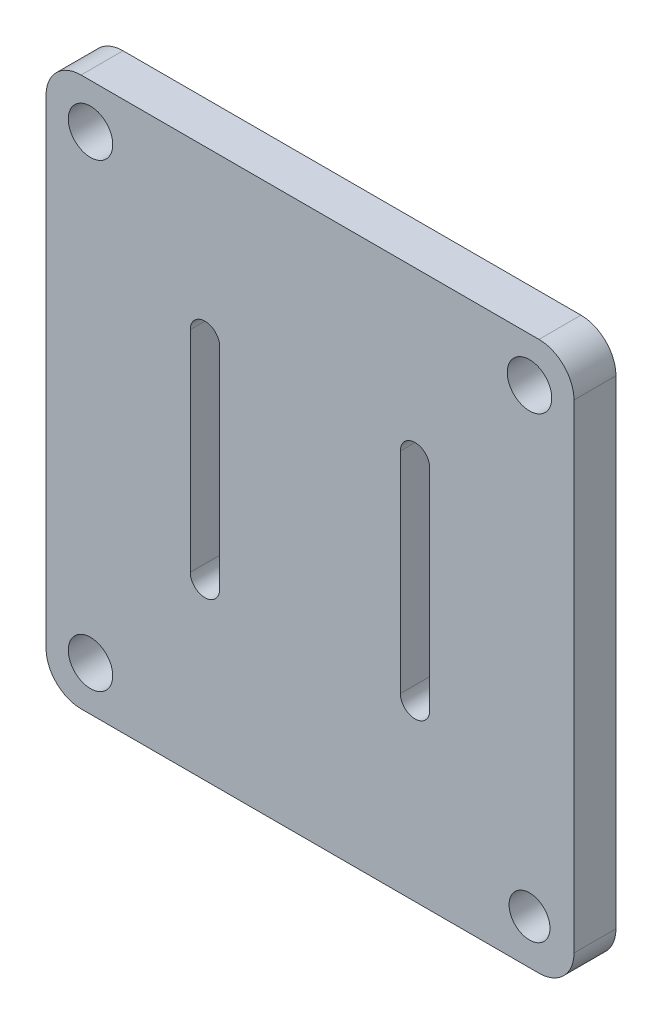
ISO-10303-21;
HEADER;
FILE_DESCRIPTION(('STEP AP214'),'2;1');
FILE_NAME('part.step','',(''),(''),'','','');
FILE_SCHEMA(('AUTOMOTIVE_DESIGN { 1 0 10303 214 1 1 1 1 }'));
ENDSEC;
DATA;
#1=APPLICATION_CONTEXT('core data for automotive mechanical design processes');
#2=APPLICATION_PROTOCOL_DEFINITION('international standard','automotive_design',2000,#1);
#3=PRODUCT_CONTEXT('',#1,'mechanical');
#4=PRODUCT('Part','Part','',(#3));
#5=PRODUCT_RELATED_PRODUCT_CATEGORY('part','',(#4));
#6=PRODUCT_DEFINITION_FORMATION('','',#4);
#7=PRODUCT_DEFINITION_CONTEXT('part definition',#1,'design');
#8=PRODUCT_DEFINITION('design','',#6,#7);
#9=PRODUCT_DEFINITION_SHAPE('','',#8);
#10=(LENGTH_UNIT() NAMED_UNIT(*) SI_UNIT(.MILLI.,.METRE.));
#11=(NAMED_UNIT(*) PLANE_ANGLE_UNIT() SI_UNIT($,.RADIAN.));
#12=(NAMED_UNIT(*) SI_UNIT($,.STERADIAN.) SOLID_ANGLE_UNIT());
#13=UNCERTAINTY_MEASURE_WITH_UNIT(LENGTH_MEASURE(1.E-05),#10,'distance_accuracy_value','');
#14=(GEOMETRIC_REPRESENTATION_CONTEXT(3) GLOBAL_UNCERTAINTY_ASSIGNED_CONTEXT((#13)) GLOBAL_UNIT_ASSIGNED_CONTEXT((#10,
#11,#12)) REPRESENTATION_CONTEXT('',''));
#15=CARTESIAN_POINT('',(0.,0.,0.));
#16=DIRECTION('',(0.,0.,1.));
#17=DIRECTION('',(1.,0.,0.));
#18=AXIS2_PLACEMENT_3D('',#15,#16,#17);
#19=CARTESIAN_POINT('',(-566.61706408043,0.,5.9944));
#20=DIRECTION('',(-1.,0.,0.));
#21=DIRECTION('',(0.,0.,1.));
#22=AXIS2_PLACEMENT_3D('',#19,#20,#21);
#23=PLANE('',#22);
#24=DIRECTION('',(0.,1.,0.));
#25=VECTOR('',#24,1.);
#26=CARTESIAN_POINT('',(-566.61706408043,0.,0.));
#27=LINE('',#26,#25);
#28=CARTESIAN_POINT('',(-566.61706408043,610.968899583057,0.));
#29=VERTEX_POINT('',#28);
#30=CARTESIAN_POINT('',(-566.61706408043,679.368899583057,0.));
#31=VERTEX_POINT('',#30);
#32=EDGE_CURVE('E217',#29,#31,#27,.T.);
#33=ORIENTED_EDGE('',*,*,#32,.T.);
#34=DIRECTION('',(0.,0.,-1.));
#35=VECTOR('',#34,1.);
#36=CARTESIAN_POINT('',(-566.61706408043,679.368899583057,5.9944));
#37=LINE('',#36,#35);
#38=CARTESIAN_POINT('',(-566.61706408043,679.368899583057,5.9944));
#39=VERTEX_POINT('',#38);
#40=EDGE_CURVE('E11',#39,#31,#37,.T.);
#41=ORIENTED_EDGE('',*,*,#40,.F.);
#42=DIRECTION('',(0.,1.,0.));
#43=VECTOR('',#42,1.);
#44=CARTESIAN_POINT('',(-566.61706408043,0.,5.9944));
#45=LINE('',#44,#43);
#46=CARTESIAN_POINT('',(-566.61706408043,610.968899583057,5.9944));
#47=VERTEX_POINT('',#46);
#48=EDGE_CURVE('E306',#47,#39,#45,.T.);
#49=ORIENTED_EDGE('',*,*,#48,.F.);
#50=DIRECTION('',(0.,0.,-1.));
#51=VECTOR('',#50,1.);
#52=CARTESIAN_POINT('',(-566.61706408043,610.968899583057,5.9944));
#53=LINE('',#52,#51);
#54=EDGE_CURVE('E232',#47,#29,#53,.T.);
#55=ORIENTED_EDGE('',*,*,#54,.T.);
#56=EDGE_LOOP('',(#33,#41,#49,#55));
#57=FACE_BOUND('',#56,.T.);
#58=ADVANCED_FACE('F33',(#57),#23,.F.);
#59=CARTESIAN_POINT('',(-571.61706408043,679.368899583057,5.9944));
#60=DIRECTION('',(0.,0.,-1.));
#61=DIRECTION('',(-1.,0.,0.));
#62=AXIS2_PLACEMENT_3D('',#59,#60,#61);
#63=CYLINDRICAL_SURFACE('',#62,5.);
#64=CARTESIAN_POINT('',(-571.61706408043,679.368899583057,0.));
#65=DIRECTION('',(0.,0.,1.));
#66=DIRECTION('',(1.,0.,0.));
#67=AXIS2_PLACEMENT_3D('',#64,#65,#66);
#68=CIRCLE('',#67,5.);
#69=CARTESIAN_POINT('',(-571.61706408043,684.368899583057,0.));
#70=VERTEX_POINT('',#69);
#71=EDGE_CURVE('E220',#31,#70,#68,.T.);
#72=ORIENTED_EDGE('',*,*,#71,.T.);
#73=DIRECTION('',(0.,0.,-1.));
#74=VECTOR('',#73,1.);
#75=CARTESIAN_POINT('',(-571.61706408043,684.368899583057,5.9944));
#76=LINE('',#75,#74);
#77=CARTESIAN_POINT('',(-571.61706408043,684.368899583057,5.9944));
#78=VERTEX_POINT('',#77);
#79=EDGE_CURVE('E43',#78,#70,#76,.T.);
#80=ORIENTED_EDGE('',*,*,#79,.F.);
#81=CARTESIAN_POINT('',(-571.61706408043,679.368899583057,5.9944));
#82=DIRECTION('',(0.,0.,1.));
#83=DIRECTION('',(1.,0.,0.));
#84=AXIS2_PLACEMENT_3D('',#81,#82,#83);
#85=CIRCLE('',#84,5.);
#86=EDGE_CURVE('E308',#39,#78,#85,.T.);
#87=ORIENTED_EDGE('',*,*,#86,.F.);
#88=ORIENTED_EDGE('',*,*,#40,.T.);
#89=EDGE_LOOP('',(#72,#80,#87,#88));
#90=FACE_BOUND('',#89,.T.);
#91=ADVANCED_FACE('F342',(#90),#63,.T.);
#92=CARTESIAN_POINT('',(0.,684.368899583057,5.9944));
#93=DIRECTION('',(0.,-1.,0.));
#94=DIRECTION('',(0.,0.,-1.));
#95=AXIS2_PLACEMENT_3D('',#92,#93,#94);
#96=PLANE('',#95);
#97=DIRECTION('',(-1.,0.,0.));
#98=VECTOR('',#97,1.);
#99=CARTESIAN_POINT('',(0.,684.368899583057,0.));
#100=LINE('',#99,#98);
#101=CARTESIAN_POINT('',(-637.017064080431,684.368899583057,0.));
#102=VERTEX_POINT('',#101);
#103=EDGE_CURVE('E222',#70,#102,#100,.T.);
#104=ORIENTED_EDGE('',*,*,#103,.T.);
#105=DIRECTION('',(0.,0.,-1.));
#106=VECTOR('',#105,1.);
#107=CARTESIAN_POINT('',(-637.017064080431,684.368899583057,5.9944));
#108=LINE('',#107,#106);
#109=CARTESIAN_POINT('',(-637.017064080431,684.368899583057,5.9944));
#110=VERTEX_POINT('',#109);
#111=EDGE_CURVE('E240',#110,#102,#108,.T.);
#112=ORIENTED_EDGE('',*,*,#111,.F.);
#113=DIRECTION('',(-1.,0.,0.));
#114=VECTOR('',#113,1.);
#115=CARTESIAN_POINT('',(0.,684.368899583057,5.9944));
#116=LINE('',#115,#114);
#117=EDGE_CURVE('E310',#78,#110,#116,.T.);
#118=ORIENTED_EDGE('',*,*,#117,.F.);
#119=ORIENTED_EDGE('',*,*,#79,.T.);
#120=EDGE_LOOP('',(#104,#112,#118,#119));
#121=FACE_BOUND('',#120,.T.);
#122=ADVANCED_FACE('F347',(#121),#96,.F.);
#123=CARTESIAN_POINT('',(-637.017064080431,679.368899583057,5.9944));
#124=DIRECTION('',(0.,0.,-1.));
#125=DIRECTION('',(-1.,0.,0.));
#126=AXIS2_PLACEMENT_3D('',#123,#124,#125);
#127=CYLINDRICAL_SURFACE('',#126,5.);
#128=CARTESIAN_POINT('',(-637.017064080431,679.368899583057,0.));
#129=DIRECTION('',(0.,0.,1.));
#130=DIRECTION('',(1.,0.,0.));
#131=AXIS2_PLACEMENT_3D('',#128,#129,#130);
#132=CIRCLE('',#131,5.);
#133=CARTESIAN_POINT('',(-642.017064080431,679.368899583057,0.));
#134=VERTEX_POINT('',#133);
#135=EDGE_CURVE('E224',#102,#134,#132,.T.);
#136=ORIENTED_EDGE('',*,*,#135,.T.);
#137=DIRECTION('',(0.,0.,-1.));
#138=VECTOR('',#137,1.);
#139=CARTESIAN_POINT('',(-642.017064080431,679.368899583057,5.9944));
#140=LINE('',#139,#138);
#141=CARTESIAN_POINT('',(-642.017064080431,679.368899583057,5.9944));
#142=VERTEX_POINT('',#141);
#143=EDGE_CURVE('E237',#142,#134,#140,.T.);
#144=ORIENTED_EDGE('',*,*,#143,.F.);
#145=CARTESIAN_POINT('',(-637.017064080431,679.368899583057,5.9944));
#146=DIRECTION('',(0.,0.,1.));
#147=DIRECTION('',(1.,0.,0.));
#148=AXIS2_PLACEMENT_3D('',#145,#146,#147);
#149=CIRCLE('',#148,5.);
#150=EDGE_CURVE('E312',#110,#142,#149,.T.);
#151=ORIENTED_EDGE('',*,*,#150,.F.);
#152=ORIENTED_EDGE('',*,*,#111,.T.);
#153=EDGE_LOOP('',(#136,#144,#151,#152));
#154=FACE_BOUND('',#153,.T.);
#155=ADVANCED_FACE('F318',(#154),#127,.T.);
#156=CARTESIAN_POINT('',(-642.017064080431,0.,5.9944));
#157=DIRECTION('',(1.,0.,0.));
#158=DIRECTION('',(0.,0.,-1.));
#159=AXIS2_PLACEMENT_3D('',#156,#157,#158);
#160=PLANE('',#159);
#161=DIRECTION('',(0.,-1.,0.));
#162=VECTOR('',#161,1.);
#163=CARTESIAN_POINT('',(-642.017064080431,0.,0.));
#164=LINE('',#163,#162);
#165=CARTESIAN_POINT('',(-642.017064080431,610.968899583057,0.));
#166=VERTEX_POINT('',#165);
#167=EDGE_CURVE('E226',#134,#166,#164,.T.);
#168=ORIENTED_EDGE('',*,*,#167,.T.);
#169=DIRECTION('',(0.,0.,-1.));
#170=VECTOR('',#169,1.);
#171=CARTESIAN_POINT('',(-642.017064080431,610.968899583057,5.9944));
#172=LINE('',#171,#170);
#173=CARTESIAN_POINT('',(-642.017064080431,610.968899583057,5.9944));
#174=VERTEX_POINT('',#173);
#175=EDGE_CURVE('E172',#174,#166,#172,.T.);
#176=ORIENTED_EDGE('',*,*,#175,.F.);
#177=DIRECTION('',(0.,-1.,0.));
#178=VECTOR('',#177,1.);
#179=CARTESIAN_POINT('',(-642.017064080431,0.,5.9944));
#180=LINE('',#179,#178);
#181=EDGE_CURVE('E163',#142,#174,#180,.T.);
#182=ORIENTED_EDGE('',*,*,#181,.F.);
#183=ORIENTED_EDGE('',*,*,#143,.T.);
#184=EDGE_LOOP('',(#168,#176,#182,#183));
#185=FACE_BOUND('',#184,.T.);
#186=ADVANCED_FACE('F322',(#185),#160,.F.);
#187=CARTESIAN_POINT('',(-637.017064080431,610.968899583057,5.9944));
#188=DIRECTION('',(0.,0.,-1.));
#189=DIRECTION('',(-1.,0.,0.));
#190=AXIS2_PLACEMENT_3D('',#187,#188,#189);
#191=CYLINDRICAL_SURFACE('',#190,5.);
#192=CARTESIAN_POINT('',(-637.017064080431,610.968899583057,0.));
#193=DIRECTION('',(0.,0.,1.));
#194=DIRECTION('',(1.,0.,0.));
#195=AXIS2_PLACEMENT_3D('',#192,#193,#194);
#196=CIRCLE('',#195,5.);
#197=CARTESIAN_POINT('',(-637.017064080431,605.968899583057,0.));
#198=VERTEX_POINT('',#197);
#199=EDGE_CURVE('E171',#166,#198,#196,.T.);
#200=ORIENTED_EDGE('',*,*,#199,.T.);
#201=DIRECTION('',(0.,0.,-1.));
#202=VECTOR('',#201,1.);
#203=CARTESIAN_POINT('',(-637.017064080431,605.968899583057,5.9944));
#204=LINE('',#203,#202);
#205=CARTESIAN_POINT('',(-637.017064080431,605.968899583057,5.9944));
#206=VERTEX_POINT('',#205);
#207=EDGE_CURVE('E168',#206,#198,#204,.T.);
#208=ORIENTED_EDGE('',*,*,#207,.F.);
#209=CARTESIAN_POINT('',(-637.017064080431,610.968899583057,5.9944));
#210=DIRECTION('',(0.,0.,1.));
#211=DIRECTION('',(1.,0.,0.));
#212=AXIS2_PLACEMENT_3D('',#209,#210,#211);
#213=CIRCLE('',#212,5.);
#214=EDGE_CURVE('E157',#174,#206,#213,.T.);
#215=ORIENTED_EDGE('',*,*,#214,.F.);
#216=ORIENTED_EDGE('',*,*,#175,.T.);
#217=EDGE_LOOP('',(#200,#208,#215,#216));
#218=FACE_BOUND('',#217,.T.);
#219=ADVANCED_FACE('F169',(#218),#191,.T.);
#220=CARTESIAN_POINT('',(0.,605.968899583057,5.9944));
#221=DIRECTION('',(0.,1.,0.));
#222=DIRECTION('',(0.,0.,1.));
#223=AXIS2_PLACEMENT_3D('',#220,#221,#222);
#224=PLANE('',#223);
#225=DIRECTION('',(1.,0.,0.));
#226=VECTOR('',#225,1.);
#227=CARTESIAN_POINT('',(0.,605.968899583057,0.));
#228=LINE('',#227,#226);
#229=CARTESIAN_POINT('',(-571.61706408043,605.968899583057,0.));
#230=VERTEX_POINT('',#229);
#231=EDGE_CURVE('E105',#198,#230,#228,.T.);
#232=ORIENTED_EDGE('',*,*,#231,.T.);
#233=DIRECTION('',(0.,0.,-1.));
#234=VECTOR('',#233,1.);
#235=CARTESIAN_POINT('',(-571.61706408043,605.968899583057,5.9944));
#236=LINE('',#235,#234);
#237=CARTESIAN_POINT('',(-571.61706408043,605.968899583057,5.9944));
#238=VERTEX_POINT('',#237);
#239=EDGE_CURVE('E173',#238,#230,#236,.T.);
#240=ORIENTED_EDGE('',*,*,#239,.F.);
#241=DIRECTION('',(1.,0.,0.));
#242=VECTOR('',#241,1.);
#243=CARTESIAN_POINT('',(0.,605.968899583057,5.9944));
#244=LINE('',#243,#242);
#245=EDGE_CURVE('E161',#206,#238,#244,.T.);
#246=ORIENTED_EDGE('',*,*,#245,.F.);
#247=ORIENTED_EDGE('',*,*,#207,.T.);
#248=EDGE_LOOP('',(#232,#240,#246,#247));
#249=FACE_BOUND('',#248,.T.);
#250=ADVANCED_FACE('F175',(#249),#224,.F.);
#251=CARTESIAN_POINT('',(-619.317064080431,660.668899583057,5.9944));
#252=DIRECTION('',(0.,0.,-1.));
#253=DIRECTION('',(-1.,0.,0.));
#254=AXIS2_PLACEMENT_3D('',#251,#252,#253);
#255=CYLINDRICAL_SURFACE('',#254,2.10214892765204);
#256=CARTESIAN_POINT('',(-619.317064080431,660.668899583057,0.));
#257=DIRECTION('',(0.,0.,1.));
#258=DIRECTION('',(1.,0.,0.));
#259=AXIS2_PLACEMENT_3D('',#256,#257,#258);
#260=CIRCLE('',#259,2.10214892765204);
#261=CARTESIAN_POINT('',(-617.214915152779,660.668899583057,0.));
#262=VERTEX_POINT('',#261);
#263=CARTESIAN_POINT('',(-621.419213008083,660.668899583057,0.));
#264=VERTEX_POINT('',#263);
#265=EDGE_CURVE('E193',#262,#264,#260,.T.);
#266=ORIENTED_EDGE('',*,*,#265,.F.);
#267=DIRECTION('',(0.,0.,-1.));
#268=VECTOR('',#267,1.);
#269=CARTESIAN_POINT('',(-617.214915152779,660.668899583057,5.9944));
#270=LINE('',#269,#268);
#271=CARTESIAN_POINT('',(-617.214915152779,660.668899583057,5.9944));
#272=VERTEX_POINT('',#271);
#273=EDGE_CURVE('E234',#272,#262,#270,.T.);
#274=ORIENTED_EDGE('',*,*,#273,.F.);
#275=CARTESIAN_POINT('',(-619.317064080431,660.668899583057,5.9944));
#276=DIRECTION('',(0.,0.,1.));
#277=DIRECTION('',(1.,0.,0.));
#278=AXIS2_PLACEMENT_3D('',#275,#276,#277);
#279=CIRCLE('',#278,2.10214892765204);
#280=CARTESIAN_POINT('',(-621.419213008083,660.668899583057,5.9944));
#281=VERTEX_POINT('',#280);
#282=EDGE_CURVE('E277',#272,#281,#279,.T.);
#283=ORIENTED_EDGE('',*,*,#282,.T.);
#284=DIRECTION('',(0.,0.,-1.));
#285=VECTOR('',#284,1.);
#286=CARTESIAN_POINT('',(-621.419213008083,660.668899583057,5.9944));
#287=LINE('',#286,#285);
#288=EDGE_CURVE('E245',#281,#264,#287,.T.);
#289=ORIENTED_EDGE('',*,*,#288,.T.);
#290=EDGE_LOOP('',(#266,#274,#283,#289));
#291=FACE_BOUND('',#290,.T.);
#292=ADVANCED_FACE('F378',(#291),#255,.F.);
#293=CARTESIAN_POINT('',(-617.214915152779,0.,5.9944));
#294=DIRECTION('',(-1.,0.,0.));
#295=DIRECTION('',(0.,0.,1.));
#296=AXIS2_PLACEMENT_3D('',#293,#294,#295);
#297=PLANE('',#296);
#298=DIRECTION('',(0.,1.,0.));
#299=VECTOR('',#298,1.);
#300=CARTESIAN_POINT('',(-617.214915152779,0.,0.));
#301=LINE('',#300,#299);
#302=CARTESIAN_POINT('',(-617.214915152779,630.668899583057,0.));
#303=VERTEX_POINT('',#302);
#304=EDGE_CURVE('E196',#303,#262,#301,.T.);
#305=ORIENTED_EDGE('',*,*,#304,.F.);
#306=DIRECTION('',(0.,0.,-1.));
#307=VECTOR('',#306,1.);
#308=CARTESIAN_POINT('',(-617.214915152779,630.668899583057,5.9944));
#309=LINE('',#308,#307);
#310=CARTESIAN_POINT('',(-617.214915152779,630.668899583057,5.9944));
#311=VERTEX_POINT('',#310);
#312=EDGE_CURVE('E249',#311,#303,#309,.T.);
#313=ORIENTED_EDGE('',*,*,#312,.F.);
#314=DIRECTION('',(0.,1.,0.));
#315=VECTOR('',#314,1.);
#316=CARTESIAN_POINT('',(-617.214915152779,0.,5.9944));
#317=LINE('',#316,#315);
#318=EDGE_CURVE('E286',#311,#272,#317,.T.);
#319=ORIENTED_EDGE('',*,*,#318,.T.);
#320=ORIENTED_EDGE('',*,*,#273,.T.);
#321=EDGE_LOOP('',(#305,#313,#319,#320));
#322=FACE_BOUND('',#321,.T.);
#323=ADVANCED_FACE('F374',(#322),#297,.T.);
#324=CARTESIAN_POINT('',(-619.317064080431,630.668899583057,5.9944));
#325=DIRECTION('',(0.,0.,-1.));
#326=DIRECTION('',(-1.,0.,0.));
#327=AXIS2_PLACEMENT_3D('',#324,#325,#326);
#328=CYLINDRICAL_SURFACE('',#327,2.10214892765204);
#329=CARTESIAN_POINT('',(-619.317064080431,630.668899583057,0.));
#330=DIRECTION('',(0.,0.,1.));
#331=DIRECTION('',(1.,0.,0.));
#332=AXIS2_PLACEMENT_3D('',#329,#330,#331);
#333=CIRCLE('',#332,2.10214892765204);
#334=CARTESIAN_POINT('',(-621.419213008083,630.668899583057,0.));
#335=VERTEX_POINT('',#334);
#336=EDGE_CURVE('E199',#335,#303,#333,.T.);
#337=ORIENTED_EDGE('',*,*,#336,.F.);
#338=DIRECTION('',(0.,0.,-1.));
#339=VECTOR('',#338,1.);
#340=CARTESIAN_POINT('',(-621.419213008083,630.668899583057,5.9944));
#341=LINE('',#340,#339);
#342=CARTESIAN_POINT('',(-621.419213008083,630.668899583057,5.9944));
#343=VERTEX_POINT('',#342);
#344=EDGE_CURVE('E247',#343,#335,#341,.T.);
#345=ORIENTED_EDGE('',*,*,#344,.F.);
#346=CARTESIAN_POINT('',(-619.317064080431,630.668899583057,5.9944));
#347=DIRECTION('',(0.,0.,1.));
#348=DIRECTION('',(1.,0.,0.));
#349=AXIS2_PLACEMENT_3D('',#346,#347,#348);
#350=CIRCLE('',#349,2.10214892765204);
#351=EDGE_CURVE('E289',#343,#311,#350,.T.);
#352=ORIENTED_EDGE('',*,*,#351,.T.);
#353=ORIENTED_EDGE('',*,*,#312,.T.);
#354=EDGE_LOOP('',(#337,#345,#352,#353));
#355=FACE_BOUND('',#354,.T.);
#356=ADVANCED_FACE('F371',(#355),#328,.F.);
#357=CARTESIAN_POINT('',(-589.31706408043,660.668899583057,5.9944));
#358=DIRECTION('',(0.,0.,-1.));
#359=DIRECTION('',(-1.,0.,0.));
#360=AXIS2_PLACEMENT_3D('',#357,#358,#359);
#361=CYLINDRICAL_SURFACE('',#360,2.09679351837089);
#362=CARTESIAN_POINT('',(-589.31706408043,660.668899583057,0.));
#363=DIRECTION('',(0.,0.,1.));
#364=DIRECTION('',(1.,0.,0.));
#365=AXIS2_PLACEMENT_3D('',#362,#363,#364);
#366=CIRCLE('',#365,2.09679351837089);
#367=CARTESIAN_POINT('',(-587.22027056206,660.668899583057,0.));
#368=VERTEX_POINT('',#367);
#369=CARTESIAN_POINT('',(-591.413857598801,660.668899583057,0.));
#370=VERTEX_POINT('',#369);
#371=EDGE_CURVE('E181',#368,#370,#366,.T.);
#372=ORIENTED_EDGE('',*,*,#371,.F.);
#373=DIRECTION('',(0.,0.,-1.));
#374=VECTOR('',#373,1.);
#375=CARTESIAN_POINT('',(-587.22027056206,660.668899583057,5.9944));
#376=LINE('',#375,#374);
#377=CARTESIAN_POINT('',(-587.22027056206,660.668899583057,5.9944));
#378=VERTEX_POINT('',#377);
#379=EDGE_CURVE('E37',#378,#368,#376,.T.);
#380=ORIENTED_EDGE('',*,*,#379,.F.);
#381=CARTESIAN_POINT('',(-589.31706408043,660.668899583057,5.9944));
#382=DIRECTION('',(0.,0.,1.));
#383=DIRECTION('',(1.,0.,0.));
#384=AXIS2_PLACEMENT_3D('',#381,#382,#383);
#385=CIRCLE('',#384,2.09679351837089);
#386=CARTESIAN_POINT('',(-591.413857598801,660.668899583057,5.9944));
#387=VERTEX_POINT('',#386);
#388=EDGE_CURVE('E231',#378,#387,#385,.T.);
#389=ORIENTED_EDGE('',*,*,#388,.T.);
#390=DIRECTION('',(0.,0.,-1.));
#391=VECTOR('',#390,1.);
#392=CARTESIAN_POINT('',(-591.413857598801,660.668899583057,5.9944));
#393=LINE('',#392,#391);
#394=EDGE_CURVE('E177',#387,#370,#393,.T.);
#395=ORIENTED_EDGE('',*,*,#394,.T.);
#396=EDGE_LOOP('',(#372,#380,#389,#395));
#397=FACE_BOUND('',#396,.T.);
#398=ADVANCED_FACE('F35',(#397),#361,.F.);
#399=CARTESIAN_POINT('',(-587.22027056206,0.,5.9944));
#400=DIRECTION('',(-1.,0.,0.));
#401=DIRECTION('',(0.,0.,1.));
#402=AXIS2_PLACEMENT_3D('',#399,#400,#401);
#403=PLANE('',#402);
#404=DIRECTION('',(0.,1.,0.));
#405=VECTOR('',#404,1.);
#406=CARTESIAN_POINT('',(-587.22027056206,0.,0.));
#407=LINE('',#406,#405);
#408=CARTESIAN_POINT('',(-587.22027056206,630.668899583057,0.));
#409=VERTEX_POINT('',#408);
#410=EDGE_CURVE('E184',#409,#368,#407,.T.);
#411=ORIENTED_EDGE('',*,*,#410,.F.);
#412=DIRECTION('',(0.,0.,-1.));
#413=VECTOR('',#412,1.);
#414=CARTESIAN_POINT('',(-587.22027056206,630.668899583057,5.9944));
#415=LINE('',#414,#413);
#416=CARTESIAN_POINT('',(-587.22027056206,630.668899583057,5.9944));
#417=VERTEX_POINT('',#416);
#418=EDGE_CURVE('E254',#417,#409,#415,.T.);
#419=ORIENTED_EDGE('',*,*,#418,.F.);
#420=DIRECTION('',(0.,1.,0.));
#421=VECTOR('',#420,1.);
#422=CARTESIAN_POINT('',(-587.22027056206,0.,5.9944));
#423=LINE('',#422,#421);
#424=EDGE_CURVE('E263',#417,#378,#423,.T.);
#425=ORIENTED_EDGE('',*,*,#424,.T.);
#426=ORIENTED_EDGE('',*,*,#379,.T.);
#427=EDGE_LOOP('',(#411,#419,#425,#426));
#428=FACE_BOUND('',#427,.T.);
#429=ADVANCED_FACE('F261',(#428),#403,.T.);
#430=CARTESIAN_POINT('',(-589.31706408043,630.668899583057,5.9944));
#431=DIRECTION('',(0.,0.,-1.));
#432=DIRECTION('',(-1.,0.,0.));
#433=AXIS2_PLACEMENT_3D('',#430,#431,#432);
#434=CYLINDRICAL_SURFACE('',#433,2.09679351837089);
#435=CARTESIAN_POINT('',(-589.31706408043,630.668899583057,0.));
#436=DIRECTION('',(0.,0.,1.));
#437=DIRECTION('',(1.,0.,0.));
#438=AXIS2_PLACEMENT_3D('',#435,#436,#437);
#439=CIRCLE('',#438,2.09679351837089);
#440=CARTESIAN_POINT('',(-591.413857598801,630.668899583057,0.));
#441=VERTEX_POINT('',#440);
#442=EDGE_CURVE('E187',#441,#409,#439,.T.);
#443=ORIENTED_EDGE('',*,*,#442,.F.);
#444=DIRECTION('',(0.,0.,-1.));
#445=VECTOR('',#444,1.);
#446=CARTESIAN_POINT('',(-591.413857598801,630.668899583057,5.9944));
#447=LINE('',#446,#445);
#448=CARTESIAN_POINT('',(-591.413857598801,630.668899583057,5.9944));
#449=VERTEX_POINT('',#448);
#450=EDGE_CURVE('E253',#449,#441,#447,.T.);
#451=ORIENTED_EDGE('',*,*,#450,.F.);
#452=CARTESIAN_POINT('',(-589.31706408043,630.668899583057,5.9944));
#453=DIRECTION('',(0.,0.,1.));
#454=DIRECTION('',(1.,0.,0.));
#455=AXIS2_PLACEMENT_3D('',#452,#453,#454);
#456=CIRCLE('',#455,2.09679351837089);
#457=EDGE_CURVE('E272',#449,#417,#456,.T.);
#458=ORIENTED_EDGE('',*,*,#457,.T.);
#459=ORIENTED_EDGE('',*,*,#418,.T.);
#460=EDGE_LOOP('',(#443,#451,#458,#459));
#461=FACE_BOUND('',#460,.T.);
#462=ADVANCED_FACE('F269',(#461),#434,.F.);
#463=CARTESIAN_POINT('',(-572.967064080431,678.018899583057,5.9944));
#464=DIRECTION('',(0.,0.,-1.));
#465=DIRECTION('',(-1.,0.,0.));
#466=AXIS2_PLACEMENT_3D('',#463,#464,#465);
#467=CYLINDRICAL_SURFACE('',#466,3.17500000000008);
#468=CARTESIAN_POINT('',(-572.967064080431,678.018899583057,5.9944));
#469=DIRECTION('',(0.,0.,1.));
#470=DIRECTION('',(1.,0.,0.));
#471=AXIS2_PLACEMENT_3D('',#468,#469,#470);
#472=CIRCLE('',#471,3.17500000000008);
#473=CARTESIAN_POINT('',(-569.79206408043,678.018899583057,5.9944));
#474=VERTEX_POINT('',#473);
#475=EDGE_CURVE('E303',#474,#474,#472,.T.);
#476=ORIENTED_EDGE('',*,*,#475,.T.);
#477=EDGE_LOOP('',(#476));
#478=FACE_BOUND('',#477,.T.);
#479=CARTESIAN_POINT('',(-572.967064080431,678.018899583057,0.));
#480=DIRECTION('',(0.,0.,1.));
#481=DIRECTION('',(1.,0.,0.));
#482=AXIS2_PLACEMENT_3D('',#479,#480,#481);
#483=CIRCLE('',#482,3.17500000000008);
#484=CARTESIAN_POINT('',(-569.79206408043,678.018899583057,0.));
#485=VERTEX_POINT('',#484);
#486=EDGE_CURVE('E214',#485,#485,#483,.T.);
#487=ORIENTED_EDGE('',*,*,#486,.F.);
#488=EDGE_LOOP('',(#487));
#489=FACE_BOUND('',#488,.T.);
#490=ADVANCED_FACE('F352',(#478,#489),#467,.F.);
#491=CARTESIAN_POINT('',(-635.66706408043,678.018899583057,5.9944));
#492=DIRECTION('',(0.,0.,-1.));
#493=DIRECTION('',(-1.,0.,0.));
#494=AXIS2_PLACEMENT_3D('',#491,#492,#493);
#495=CYLINDRICAL_SURFACE('',#494,3.17500000000008);
#496=CARTESIAN_POINT('',(-635.66706408043,678.018899583057,5.9944));
#497=DIRECTION('',(0.,0.,1.));
#498=DIRECTION('',(1.,0.,0.));
#499=AXIS2_PLACEMENT_3D('',#496,#497,#498);
#500=CIRCLE('',#499,3.17500000000008);
#501=CARTESIAN_POINT('',(-632.492064080431,678.018899583057,5.9944));
#502=VERTEX_POINT('',#501);
#503=EDGE_CURVE('E300',#502,#502,#500,.T.);
#504=ORIENTED_EDGE('',*,*,#503,.T.);
#505=EDGE_LOOP('',(#504));
#506=FACE_BOUND('',#505,.T.);
#507=CARTESIAN_POINT('',(-635.66706408043,678.018899583057,0.));
#508=DIRECTION('',(0.,0.,1.));
#509=DIRECTION('',(1.,0.,0.));
#510=AXIS2_PLACEMENT_3D('',#507,#508,#509);
#511=CIRCLE('',#510,3.17500000000008);
#512=CARTESIAN_POINT('',(-632.492064080431,678.018899583057,0.));
#513=VERTEX_POINT('',#512);
#514=EDGE_CURVE('E211',#513,#513,#511,.T.);
#515=ORIENTED_EDGE('',*,*,#514,.F.);
#516=EDGE_LOOP('',(#515));
#517=FACE_BOUND('',#516,.T.);
#518=ADVANCED_FACE('F355',(#506,#517),#495,.F.);
#519=CARTESIAN_POINT('',(-635.66706408043,612.318899583057,5.9944));
#520=DIRECTION('',(0.,0.,-1.));
#521=DIRECTION('',(-1.,0.,0.));
#522=AXIS2_PLACEMENT_3D('',#519,#520,#521);
#523=CYLINDRICAL_SURFACE('',#522,3.17500000000008);
#524=CARTESIAN_POINT('',(-635.66706408043,612.318899583057,5.9944));
#525=DIRECTION('',(0.,0.,1.));
#526=DIRECTION('',(1.,0.,0.));
#527=AXIS2_PLACEMENT_3D('',#524,#525,#526);
#528=CIRCLE('',#527,3.17500000000008);
#529=CARTESIAN_POINT('',(-632.492064080431,612.318899583057,5.9944));
#530=VERTEX_POINT('',#529);
#531=EDGE_CURVE('E297',#530,#530,#528,.T.);
#532=ORIENTED_EDGE('',*,*,#531,.T.);
#533=EDGE_LOOP('',(#532));
#534=FACE_BOUND('',#533,.T.);
#535=CARTESIAN_POINT('',(-635.66706408043,612.318899583057,0.));
#536=DIRECTION('',(0.,0.,1.));
#537=DIRECTION('',(1.,0.,0.));
#538=AXIS2_PLACEMENT_3D('',#535,#536,#537);
#539=CIRCLE('',#538,3.17500000000008);
#540=CARTESIAN_POINT('',(-632.492064080431,612.318899583057,0.));
#541=VERTEX_POINT('',#540);
#542=EDGE_CURVE('E208',#541,#541,#539,.T.);
#543=ORIENTED_EDGE('',*,*,#542,.F.);
#544=EDGE_LOOP('',(#543));
#545=FACE_BOUND('',#544,.T.);
#546=ADVANCED_FACE('F359',(#534,#545),#523,.F.);
#547=CARTESIAN_POINT('',(-572.967064080431,612.318899583057,5.9944));
#548=DIRECTION('',(0.,0.,-1.));
#549=DIRECTION('',(-1.,0.,0.));
#550=AXIS2_PLACEMENT_3D('',#547,#548,#549);
#551=CYLINDRICAL_SURFACE('',#550,2.92099999999994);
#552=CARTESIAN_POINT('',(-572.967064080431,612.318899583057,5.9944));
#553=DIRECTION('',(0.,0.,1.));
#554=DIRECTION('',(1.,0.,0.));
#555=AXIS2_PLACEMENT_3D('',#552,#553,#554);
#556=CIRCLE('',#555,2.92099999999994);
#557=CARTESIAN_POINT('',(-570.046064080431,612.318899583057,5.9944));
#558=VERTEX_POINT('',#557);
#559=EDGE_CURVE('E294',#558,#558,#556,.T.);
#560=ORIENTED_EDGE('',*,*,#559,.T.);
#561=EDGE_LOOP('',(#560));
#562=FACE_BOUND('',#561,.T.);
#563=CARTESIAN_POINT('',(-572.967064080431,612.318899583057,0.));
#564=DIRECTION('',(0.,0.,1.));
#565=DIRECTION('',(1.,0.,0.));
#566=AXIS2_PLACEMENT_3D('',#563,#564,#565);
#567=CIRCLE('',#566,2.92099999999994);
#568=CARTESIAN_POINT('',(-570.046064080431,612.318899583057,0.));
#569=VERTEX_POINT('',#568);
#570=EDGE_CURVE('E205',#569,#569,#567,.T.);
#571=ORIENTED_EDGE('',*,*,#570,.F.);
#572=EDGE_LOOP('',(#571));
#573=FACE_BOUND('',#572,.T.);
#574=ADVANCED_FACE('F363',(#562,#573),#551,.F.);
#575=CARTESIAN_POINT('',(-621.419213008083,0.,5.9944));
#576=DIRECTION('',(-1.,0.,0.));
#577=DIRECTION('',(0.,0.,1.));
#578=AXIS2_PLACEMENT_3D('',#575,#576,#577);
#579=PLANE('',#578);
#580=DIRECTION('',(0.,1.,0.));
#581=VECTOR('',#580,1.);
#582=CARTESIAN_POINT('',(-621.419213008083,0.,0.));
#583=LINE('',#582,#581);
#584=EDGE_CURVE('E202',#335,#264,#583,.T.);
#585=ORIENTED_EDGE('',*,*,#584,.T.);
#586=ORIENTED_EDGE('',*,*,#288,.F.);
#587=DIRECTION('',(0.,1.,0.));
#588=VECTOR('',#587,1.);
#589=CARTESIAN_POINT('',(-621.419213008083,0.,5.9944));
#590=LINE('',#589,#588);
#591=EDGE_CURVE('E292',#343,#281,#590,.T.);
#592=ORIENTED_EDGE('',*,*,#591,.F.);
#593=ORIENTED_EDGE('',*,*,#344,.T.);
#594=EDGE_LOOP('',(#585,#586,#592,#593));
#595=FACE_BOUND('',#594,.T.);
#596=ADVANCED_FACE('F337',(#595),#579,.F.);
#597=CARTESIAN_POINT('',(-591.413857598801,0.,5.9944));
#598=DIRECTION('',(-1.,0.,0.));
#599=DIRECTION('',(0.,0.,1.));
#600=AXIS2_PLACEMENT_3D('',#597,#598,#599);
#601=PLANE('',#600);
#602=DIRECTION('',(0.,1.,0.));
#603=VECTOR('',#602,1.);
#604=CARTESIAN_POINT('',(-591.413857598801,0.,0.));
#605=LINE('',#604,#603);
#606=EDGE_CURVE('E190',#441,#370,#605,.T.);
#607=ORIENTED_EDGE('',*,*,#606,.T.);
#608=ORIENTED_EDGE('',*,*,#394,.F.);
#609=DIRECTION('',(0.,1.,0.));
#610=VECTOR('',#609,1.);
#611=CARTESIAN_POINT('',(-591.413857598801,0.,5.9944));
#612=LINE('',#611,#610);
#613=EDGE_CURVE('E274',#449,#387,#612,.T.);
#614=ORIENTED_EDGE('',*,*,#613,.F.);
#615=ORIENTED_EDGE('',*,*,#450,.T.);
#616=EDGE_LOOP('',(#607,#608,#614,#615));
#617=FACE_BOUND('',#616,.T.);
#618=ADVANCED_FACE('F275',(#617),#601,.F.);
#619=CARTESIAN_POINT('',(-571.61706408043,610.968899583057,5.9944));
#620=DIRECTION('',(0.,0.,-1.));
#621=DIRECTION('',(-1.,0.,0.));
#622=AXIS2_PLACEMENT_3D('',#619,#620,#621);
#623=CYLINDRICAL_SURFACE('',#622,5.);
#624=CARTESIAN_POINT('',(-571.61706408043,610.968899583057,0.));
#625=DIRECTION('',(0.,0.,1.));
#626=DIRECTION('',(1.,0.,0.));
#627=AXIS2_PLACEMENT_3D('',#624,#625,#626);
#628=CIRCLE('',#627,5.);
#629=EDGE_CURVE('E111',#230,#29,#628,.T.);
#630=ORIENTED_EDGE('',*,*,#629,.T.);
#631=ORIENTED_EDGE('',*,*,#54,.F.);
#632=CARTESIAN_POINT('',(-571.61706408043,610.968899583057,5.9944));
#633=DIRECTION('',(0.,0.,1.));
#634=DIRECTION('',(1.,0.,0.));
#635=AXIS2_PLACEMENT_3D('',#632,#633,#634);
#636=CIRCLE('',#635,5.);
#637=EDGE_CURVE('E52',#238,#47,#636,.T.);
#638=ORIENTED_EDGE('',*,*,#637,.F.);
#639=ORIENTED_EDGE('',*,*,#239,.T.);
#640=EDGE_LOOP('',(#630,#631,#638,#639));
#641=FACE_BOUND('',#640,.T.);
#642=ADVANCED_FACE('F329',(#641),#623,.T.);
#643=CARTESIAN_POINT('',(0.,0.,5.9944));
#644=DIRECTION('',(0.,0.,1.));
#645=DIRECTION('',(1.,0.,0.));
#646=AXIS2_PLACEMENT_3D('',#643,#644,#645);
#647=PLANE('',#646);
#648=ORIENTED_EDGE('',*,*,#388,.F.);
#649=ORIENTED_EDGE('',*,*,#424,.F.);
#650=ORIENTED_EDGE('',*,*,#457,.F.);
#651=ORIENTED_EDGE('',*,*,#613,.T.);
#652=EDGE_LOOP('',(#648,#649,#650,#651));
#653=FACE_BOUND('',#652,.T.);
#654=ORIENTED_EDGE('',*,*,#282,.F.);
#655=ORIENTED_EDGE('',*,*,#318,.F.);
#656=ORIENTED_EDGE('',*,*,#351,.F.);
#657=ORIENTED_EDGE('',*,*,#591,.T.);
#658=EDGE_LOOP('',(#654,#655,#656,#657));
#659=FACE_BOUND('',#658,.T.);
#660=ORIENTED_EDGE('',*,*,#559,.F.);
#661=EDGE_LOOP('',(#660));
#662=FACE_BOUND('',#661,.T.);
#663=ORIENTED_EDGE('',*,*,#531,.F.);
#664=EDGE_LOOP('',(#663));
#665=FACE_BOUND('',#664,.T.);
#666=ORIENTED_EDGE('',*,*,#503,.F.);
#667=EDGE_LOOP('',(#666));
#668=FACE_BOUND('',#667,.T.);
#669=ORIENTED_EDGE('',*,*,#475,.F.);
#670=EDGE_LOOP('',(#669));
#671=FACE_BOUND('',#670,.T.);
#672=ORIENTED_EDGE('',*,*,#48,.T.);
#673=ORIENTED_EDGE('',*,*,#86,.T.);
#674=ORIENTED_EDGE('',*,*,#117,.T.);
#675=ORIENTED_EDGE('',*,*,#150,.T.);
#676=ORIENTED_EDGE('',*,*,#181,.T.);
#677=ORIENTED_EDGE('',*,*,#214,.T.);
#678=ORIENTED_EDGE('',*,*,#245,.T.);
#679=ORIENTED_EDGE('',*,*,#637,.T.);
#680=EDGE_LOOP('',(#672,#673,#674,#675,#676,#677,#678,#679));
#681=FACE_BOUND('',#680,.T.);
#682=ADVANCED_FACE('F159',(#653,#659,#662,#665,#668,#671,#681),#647,.T.);
#683=CARTESIAN_POINT('',(0.,0.,0.));
#684=DIRECTION('',(0.,0.,1.));
#685=DIRECTION('',(1.,0.,0.));
#686=AXIS2_PLACEMENT_3D('',#683,#684,#685);
#687=PLANE('',#686);
#688=ORIENTED_EDGE('',*,*,#371,.T.);
#689=ORIENTED_EDGE('',*,*,#606,.F.);
#690=ORIENTED_EDGE('',*,*,#442,.T.);
#691=ORIENTED_EDGE('',*,*,#410,.T.);
#692=EDGE_LOOP('',(#688,#689,#690,#691));
#693=FACE_BOUND('',#692,.T.);
#694=ORIENTED_EDGE('',*,*,#265,.T.);
#695=ORIENTED_EDGE('',*,*,#584,.F.);
#696=ORIENTED_EDGE('',*,*,#336,.T.);
#697=ORIENTED_EDGE('',*,*,#304,.T.);
#698=EDGE_LOOP('',(#694,#695,#696,#697));
#699=FACE_BOUND('',#698,.T.);
#700=ORIENTED_EDGE('',*,*,#570,.T.);
#701=EDGE_LOOP('',(#700));
#702=FACE_BOUND('',#701,.T.);
#703=ORIENTED_EDGE('',*,*,#542,.T.);
#704=EDGE_LOOP('',(#703));
#705=FACE_BOUND('',#704,.T.);
#706=ORIENTED_EDGE('',*,*,#514,.T.);
#707=EDGE_LOOP('',(#706));
#708=FACE_BOUND('',#707,.T.);
#709=ORIENTED_EDGE('',*,*,#486,.T.);
#710=EDGE_LOOP('',(#709));
#711=FACE_BOUND('',#710,.T.);
#712=ORIENTED_EDGE('',*,*,#32,.F.);
#713=ORIENTED_EDGE('',*,*,#629,.F.);
#714=ORIENTED_EDGE('',*,*,#231,.F.);
#715=ORIENTED_EDGE('',*,*,#199,.F.);
#716=ORIENTED_EDGE('',*,*,#167,.F.);
#717=ORIENTED_EDGE('',*,*,#135,.F.);
#718=ORIENTED_EDGE('',*,*,#103,.F.);
#719=ORIENTED_EDGE('',*,*,#71,.F.);
#720=EDGE_LOOP('',(#712,#713,#714,#715,#716,#717,#718,#719));
#721=FACE_BOUND('',#720,.T.);
#722=ADVANCED_FACE('F267',(#693,#699,#702,#705,#708,#711,#721),#687,.F.);
#723=CLOSED_SHELL('',(#58,#91,#122,#155,#186,#219,#250,#292,#323,#356,#398,#429,#462,#490,#518,
#546,#574,#596,#618,#642,#682,#722));
#724=MANIFOLD_SOLID_BREP('B2',#723);
#725=ADVANCED_BREP_SHAPE_REPRESENTATION('',(#18,#724),#14);
#726=SHAPE_DEFINITION_REPRESENTATION(#9,#725);
ENDSEC;
END-ISO-10303-21;
